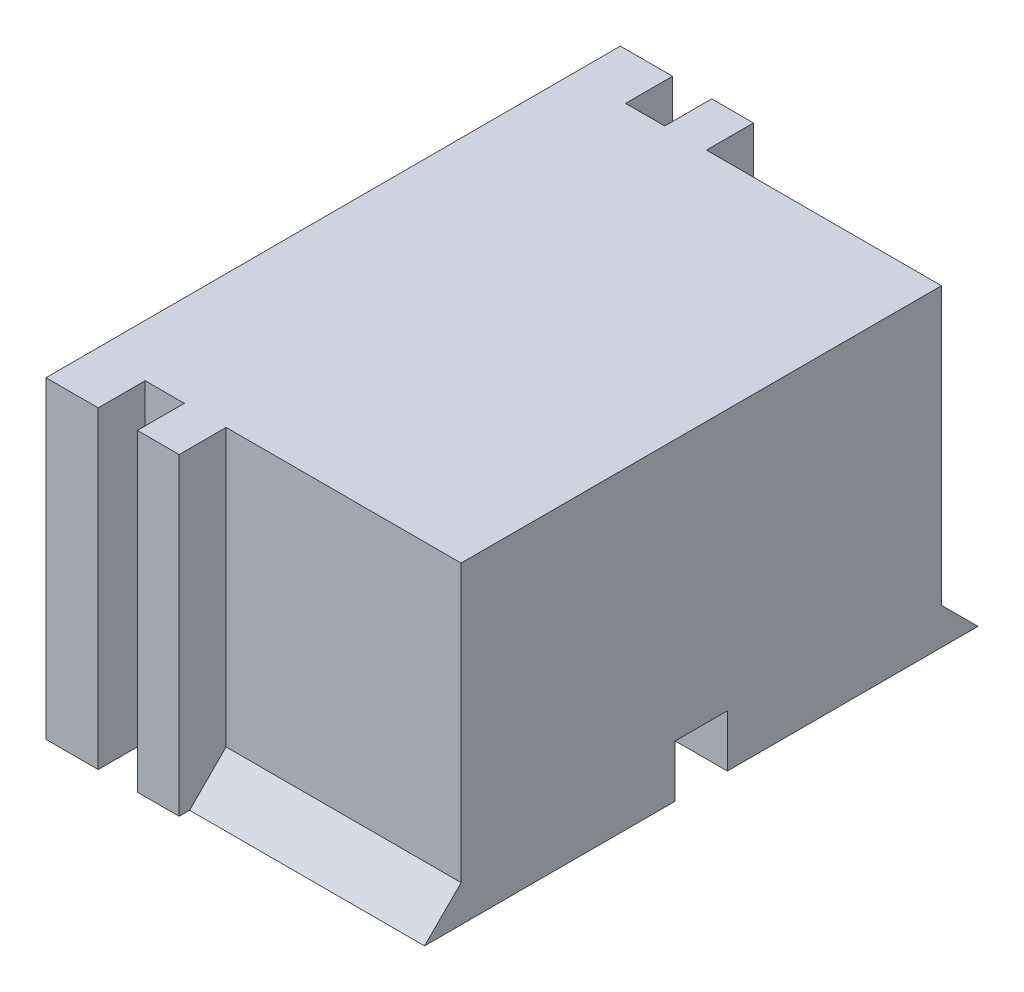
ISO-10303-21;
HEADER;
FILE_DESCRIPTION(('STEP AP214'),'2;1');
FILE_NAME('part.step','',(''),(''),'','','');
FILE_SCHEMA(('AUTOMOTIVE_DESIGN { 1 0 10303 214 1 1 1 1 }'));
ENDSEC;
DATA;
#1=APPLICATION_CONTEXT('core data for automotive mechanical design processes');
#2=APPLICATION_PROTOCOL_DEFINITION('international standard','automotive_design',2000,#1);
#3=PRODUCT_CONTEXT('',#1,'mechanical');
#4=PRODUCT('Part','Part','',(#3));
#5=PRODUCT_RELATED_PRODUCT_CATEGORY('part','',(#4));
#6=PRODUCT_DEFINITION_FORMATION('','',#4);
#7=PRODUCT_DEFINITION_CONTEXT('part definition',#1,'design');
#8=PRODUCT_DEFINITION('design','',#6,#7);
#9=PRODUCT_DEFINITION_SHAPE('','',#8);
#10=(LENGTH_UNIT() NAMED_UNIT(*) SI_UNIT(.MILLI.,.METRE.));
#11=(NAMED_UNIT(*) PLANE_ANGLE_UNIT() SI_UNIT($,.RADIAN.));
#12=(NAMED_UNIT(*) SI_UNIT($,.STERADIAN.) SOLID_ANGLE_UNIT());
#13=UNCERTAINTY_MEASURE_WITH_UNIT(LENGTH_MEASURE(1.E-05),#10,'distance_accuracy_value','');
#14=(GEOMETRIC_REPRESENTATION_CONTEXT(3) GLOBAL_UNCERTAINTY_ASSIGNED_CONTEXT((#13)) GLOBAL_UNIT_ASSIGNED_CONTEXT((#10,
#11,#12)) REPRESENTATION_CONTEXT('',''));
#15=CARTESIAN_POINT('',(0.,0.,0.));
#16=DIRECTION('',(0.,0.,1.));
#17=DIRECTION('',(1.,0.,0.));
#18=AXIS2_PLACEMENT_3D('',#15,#16,#17);
#19=CARTESIAN_POINT('',(-2.08730158730159,-5.26031746031746,11.));
#20=DIRECTION('',(0.,1.,0.));
#21=DIRECTION('',(0.,0.,1.));
#22=AXIS2_PLACEMENT_3D('',#19,#20,#21);
#23=PLANE('',#22);
#24=DIRECTION('',(1.,0.,0.));
#25=VECTOR('',#24,1.);
#26=CARTESIAN_POINT('',(0.0126984126984104,-5.26031746031746,12.));
#27=LINE('',#26,#25);
#28=CARTESIAN_POINT('',(0.0126984126984104,-5.26031746031746,12.));
#29=VERTEX_POINT('',#28);
#30=CARTESIAN_POINT('',(12.0126984126984,-5.26031746031746,12.));
#31=VERTEX_POINT('',#30);
#32=EDGE_CURVE('E209',#29,#31,#27,.T.);
#33=ORIENTED_EDGE('',*,*,#32,.T.);
#34=DIRECTION('',(0.,0.,1.));
#35=VECTOR('',#34,1.);
#36=CARTESIAN_POINT('',(12.0126984126984,-5.26031746031746,11.));
#37=LINE('',#36,#35);
#38=CARTESIAN_POINT('',(12.0126984126984,-5.26031746031746,21.6));
#39=VERTEX_POINT('',#38);
#40=EDGE_CURVE('E306',#31,#39,#37,.T.);
#41=ORIENTED_EDGE('',*,*,#40,.T.);
#42=DIRECTION('',(1.,0.,0.));
#43=VECTOR('',#42,1.);
#44=CARTESIAN_POINT('',(3.01269841269841,-5.26031746031746,21.6));
#45=LINE('',#44,#43);
#46=CARTESIAN_POINT('',(3.01269841269841,-5.26031746031746,21.6));
#47=VERTEX_POINT('',#46);
#48=EDGE_CURVE('E230',#47,#39,#45,.T.);
#49=ORIENTED_EDGE('',*,*,#48,.F.);
#50=DIRECTION('',(0.,0.,1.));
#51=VECTOR('',#50,1.);
#52=CARTESIAN_POINT('',(3.01269841269841,-5.26031746031746,20.2));
#53=LINE('',#52,#51);
#54=CARTESIAN_POINT('',(3.01269841269841,-5.26031746031746,22.));
#55=VERTEX_POINT('',#54);
#56=EDGE_CURVE('E253',#47,#55,#53,.T.);
#57=ORIENTED_EDGE('',*,*,#56,.T.);
#58=DIRECTION('',(1.,0.,0.));
#59=VECTOR('',#58,1.);
#60=CARTESIAN_POINT('',(-2.08730158730159,-5.26031746031746,22.));
#61=LINE('',#60,#59);
#62=CARTESIAN_POINT('',(1.41269841269841,-5.26031746031746,22.));
#63=VERTEX_POINT('',#62);
#64=EDGE_CURVE('E301',#63,#55,#61,.T.);
#65=ORIENTED_EDGE('',*,*,#64,.F.);
#66=DIRECTION('',(0.,0.,1.));
#67=VECTOR('',#66,1.);
#68=CARTESIAN_POINT('',(1.41269841269841,-5.26031746031746,20.2));
#69=LINE('',#68,#67);
#70=CARTESIAN_POINT('',(1.41269841269841,-5.26031746031746,20.2));
#71=VERTEX_POINT('',#70);
#72=EDGE_CURVE('E281',#71,#63,#69,.T.);
#73=ORIENTED_EDGE('',*,*,#72,.F.);
#74=DIRECTION('',(-1.,0.,0.));
#75=VECTOR('',#74,1.);
#76=CARTESIAN_POINT('',(1.41269841269841,-5.26031746031746,20.2));
#77=LINE('',#76,#75);
#78=CARTESIAN_POINT('',(-0.0873015873015903,-5.26031746031746,20.2));
#79=VERTEX_POINT('',#78);
#80=EDGE_CURVE('E271',#71,#79,#77,.T.);
#81=ORIENTED_EDGE('',*,*,#80,.T.);
#82=DIRECTION('',(0.,0.,1.));
#83=VECTOR('',#82,1.);
#84=CARTESIAN_POINT('',(-0.0873015873015903,-5.26031746031746,20.2));
#85=LINE('',#84,#83);
#86=CARTESIAN_POINT('',(-0.0873015873015903,-5.26031746031746,22.));
#87=VERTEX_POINT('',#86);
#88=EDGE_CURVE('E285',#79,#87,#85,.T.);
#89=ORIENTED_EDGE('',*,*,#88,.T.);
#90=CARTESIAN_POINT('',(-2.08730158730159,-5.26031746031746,22.));
#91=VERTEX_POINT('',#90);
#92=EDGE_CURVE('E302',#91,#87,#61,.T.);
#93=ORIENTED_EDGE('',*,*,#92,.F.);
#94=DIRECTION('',(0.,0.,-1.));
#95=VECTOR('',#94,1.);
#96=CARTESIAN_POINT('',(-2.08730158730159,-5.26031746031746,11.));
#97=LINE('',#96,#95);
#98=CARTESIAN_POINT('',(-2.08730158730159,-5.26031746031746,0.));
#99=VERTEX_POINT('',#98);
#100=EDGE_CURVE('E11',#91,#99,#97,.T.);
#101=ORIENTED_EDGE('',*,*,#100,.T.);
#102=DIRECTION('',(1.,0.,0.));
#103=VECTOR('',#102,1.);
#104=CARTESIAN_POINT('',(-2.08730158730159,-5.26031746031746,0.));
#105=LINE('',#104,#103);
#106=CARTESIAN_POINT('',(-0.0873015873015903,-5.26031746031746,0.));
#107=VERTEX_POINT('',#106);
#108=EDGE_CURVE('E401',#99,#107,#105,.T.);
#109=ORIENTED_EDGE('',*,*,#108,.T.);
#110=DIRECTION('',(0.,0.,-1.));
#111=VECTOR('',#110,1.);
#112=CARTESIAN_POINT('',(-0.0873015873015903,-5.26031746031746,1.8));
#113=LINE('',#112,#111);
#114=CARTESIAN_POINT('',(-0.0873015873015903,-5.26031746031746,1.8));
#115=VERTEX_POINT('',#114);
#116=EDGE_CURVE('E391',#115,#107,#113,.T.);
#117=ORIENTED_EDGE('',*,*,#116,.F.);
#118=DIRECTION('',(-1.,0.,0.));
#119=VECTOR('',#118,1.);
#120=CARTESIAN_POINT('',(1.41269841269841,-5.26031746031746,1.8));
#121=LINE('',#120,#119);
#122=CARTESIAN_POINT('',(1.41269841269841,-5.26031746031746,1.8));
#123=VERTEX_POINT('',#122);
#124=EDGE_CURVE('E364',#123,#115,#121,.T.);
#125=ORIENTED_EDGE('',*,*,#124,.F.);
#126=DIRECTION('',(0.,0.,-1.));
#127=VECTOR('',#126,1.);
#128=CARTESIAN_POINT('',(1.41269841269841,-5.26031746031746,1.8));
#129=LINE('',#128,#127);
#130=CARTESIAN_POINT('',(1.41269841269841,-5.26031746031746,0.));
#131=VERTEX_POINT('',#130);
#132=EDGE_CURVE('E377',#123,#131,#129,.T.);
#133=ORIENTED_EDGE('',*,*,#132,.T.);
#134=CARTESIAN_POINT('',(3.01269841269841,-5.26031746031746,0.));
#135=VERTEX_POINT('',#134);
#136=EDGE_CURVE('E400',#131,#135,#105,.T.);
#137=ORIENTED_EDGE('',*,*,#136,.T.);
#138=DIRECTION('',(0.,0.,-1.));
#139=VECTOR('',#138,1.);
#140=CARTESIAN_POINT('',(3.01269841269841,-5.26031746031746,1.8));
#141=LINE('',#140,#139);
#142=CARTESIAN_POINT('',(3.01269841269841,-5.26031746031746,0.4));
#143=VERTEX_POINT('',#142);
#144=EDGE_CURVE('E350',#143,#135,#141,.T.);
#145=ORIENTED_EDGE('',*,*,#144,.F.);
#146=DIRECTION('',(1.,0.,0.));
#147=VECTOR('',#146,1.);
#148=CARTESIAN_POINT('',(3.01269841269841,-5.26031746031746,0.4));
#149=LINE('',#148,#147);
#150=CARTESIAN_POINT('',(12.0126984126984,-5.26031746031746,0.4));
#151=VERTEX_POINT('',#150);
#152=EDGE_CURVE('E328',#143,#151,#149,.T.);
#153=ORIENTED_EDGE('',*,*,#152,.T.);
#154=DIRECTION('',(0.,0.,-1.));
#155=VECTOR('',#154,1.);
#156=CARTESIAN_POINT('',(12.0126984126984,-5.26031746031746,11.));
#157=LINE('',#156,#155);
#158=CARTESIAN_POINT('',(12.0126984126984,-5.26031746031746,10.));
#159=VERTEX_POINT('',#158);
#160=EDGE_CURVE('E48',#159,#151,#157,.T.);
#161=ORIENTED_EDGE('',*,*,#160,.F.);
#162=DIRECTION('',(1.,0.,0.));
#163=VECTOR('',#162,1.);
#164=CARTESIAN_POINT('',(0.0126984126984104,-5.26031746031746,10.));
#165=LINE('',#164,#163);
#166=CARTESIAN_POINT('',(0.0126984126984104,-5.26031746031746,10.));
#167=VERTEX_POINT('',#166);
#168=EDGE_CURVE('E200',#167,#159,#165,.T.);
#169=ORIENTED_EDGE('',*,*,#168,.F.);
#170=DIRECTION('',(0.,0.,-1.));
#171=VECTOR('',#170,1.);
#172=CARTESIAN_POINT('',(0.0126984126984104,-5.26031746031746,11.));
#173=LINE('',#172,#171);
#174=EDGE_CURVE('E310',#29,#167,#173,.T.);
#175=ORIENTED_EDGE('',*,*,#174,.F.);
#176=EDGE_LOOP('',(#33,#41,#49,#57,#65,#73,#81,#89,#93,#101,#109,#117,#125,#133,#137,#145,#153,
#161,#169,#175));
#177=FACE_BOUND('',#176,.T.);
#178=ADVANCED_FACE('F39',(#177),#23,.F.);
#179=CARTESIAN_POINT('',(12.0126984126984,6.73968253968254,11.));
#180=DIRECTION('',(-1.,0.,0.));
#181=DIRECTION('',(0.,0.,1.));
#182=AXIS2_PLACEMENT_3D('',#179,#180,#181);
#183=PLANE('',#182);
#184=DIRECTION('',(0.,1.,0.));
#185=VECTOR('',#184,1.);
#186=CARTESIAN_POINT('',(12.0126984126984,-3.26031746031746,12.));
#187=LINE('',#186,#185);
#188=CARTESIAN_POINT('',(12.0126984126984,-3.26031746031746,12.));
#189=VERTEX_POINT('',#188);
#190=EDGE_CURVE('E211',#31,#189,#187,.T.);
#191=ORIENTED_EDGE('',*,*,#190,.T.);
#192=DIRECTION('',(0.,0.,1.));
#193=VECTOR('',#192,1.);
#194=CARTESIAN_POINT('',(12.0126984126984,-3.26031746031746,11.));
#195=LINE('',#194,#193);
#196=CARTESIAN_POINT('',(12.0126984126984,-3.26031746031746,10.));
#197=VERTEX_POINT('',#196);
#198=EDGE_CURVE('E215',#197,#189,#195,.T.);
#199=ORIENTED_EDGE('',*,*,#198,.F.);
#200=DIRECTION('',(0.,1.,0.));
#201=VECTOR('',#200,1.);
#202=CARTESIAN_POINT('',(12.0126984126984,-3.26031746031746,10.));
#203=LINE('',#202,#201);
#204=EDGE_CURVE('E309',#159,#197,#203,.T.);
#205=ORIENTED_EDGE('',*,*,#204,.F.);
#206=ORIENTED_EDGE('',*,*,#160,.T.);
#207=DIRECTION('',(0.,0.707106781186548,0.707106781186547));
#208=VECTOR('',#207,1.);
#209=CARTESIAN_POINT('',(12.0126984126984,-5.26031746031746,0.4));
#210=LINE('',#209,#208);
#211=CARTESIAN_POINT('',(12.0126984126984,-3.86031746031746,1.8));
#212=VERTEX_POINT('',#211);
#213=EDGE_CURVE('E323',#151,#212,#210,.T.);
#214=ORIENTED_EDGE('',*,*,#213,.T.);
#215=DIRECTION('',(0.,-1.,0.));
#216=VECTOR('',#215,1.);
#217=CARTESIAN_POINT('',(12.0126984126984,6.73968253968254,1.8));
#218=LINE('',#217,#216);
#219=CARTESIAN_POINT('',(12.0126984126984,6.73968253968254,1.8));
#220=VERTEX_POINT('',#219);
#221=EDGE_CURVE('E340',#220,#212,#218,.T.);
#222=ORIENTED_EDGE('',*,*,#221,.F.);
#223=DIRECTION('',(0.,0.,-1.));
#224=VECTOR('',#223,1.);
#225=CARTESIAN_POINT('',(12.0126984126984,6.73968253968254,11.));
#226=LINE('',#225,#224);
#227=CARTESIAN_POINT('',(12.0126984126984,6.73968253968254,20.2));
#228=VERTEX_POINT('',#227);
#229=EDGE_CURVE('E413',#228,#220,#226,.T.);
#230=ORIENTED_EDGE('',*,*,#229,.F.);
#231=DIRECTION('',(0.,-1.,0.));
#232=VECTOR('',#231,1.);
#233=CARTESIAN_POINT('',(12.0126984126984,6.73968253968254,20.2));
#234=LINE('',#233,#232);
#235=CARTESIAN_POINT('',(12.0126984126984,-3.86031746031746,20.2));
#236=VERTEX_POINT('',#235);
#237=EDGE_CURVE('E238',#228,#236,#234,.T.);
#238=ORIENTED_EDGE('',*,*,#237,.T.);
#239=DIRECTION('',(0.,0.707106781186548,-0.707106781186547));
#240=VECTOR('',#239,1.);
#241=CARTESIAN_POINT('',(12.0126984126984,-5.26031746031746,21.6));
#242=LINE('',#241,#240);
#243=EDGE_CURVE('E219',#39,#236,#242,.T.);
#244=ORIENTED_EDGE('',*,*,#243,.F.);
#245=ORIENTED_EDGE('',*,*,#40,.F.);
#246=EDGE_LOOP('',(#191,#199,#205,#206,#214,#222,#230,#238,#244,#245));
#247=FACE_BOUND('',#246,.T.);
#248=ADVANCED_FACE('F419',(#247),#183,.F.);
#249=CARTESIAN_POINT('',(3.01269841269841,6.73968253968254,20.2));
#250=DIRECTION('',(1.,0.,0.));
#251=DIRECTION('',(0.,1.,0.));
#252=AXIS2_PLACEMENT_3D('',#249,#250,#251);
#253=PLANE('',#252);
#254=ORIENTED_EDGE('',*,*,#56,.F.);
#255=DIRECTION('',(0.,0.707106781186548,-0.707106781186547));
#256=VECTOR('',#255,1.);
#257=CARTESIAN_POINT('',(3.01269841269841,-5.26031746031746,21.6));
#258=LINE('',#257,#256);
#259=CARTESIAN_POINT('',(3.01269841269841,-3.86031746031746,20.2));
#260=VERTEX_POINT('',#259);
#261=EDGE_CURVE('E223',#47,#260,#258,.T.);
#262=ORIENTED_EDGE('',*,*,#261,.T.);
#263=DIRECTION('',(0.,1.,0.));
#264=VECTOR('',#263,1.);
#265=CARTESIAN_POINT('',(3.01269841269841,6.73968253968254,20.2));
#266=LINE('',#265,#264);
#267=CARTESIAN_POINT('',(3.01269841269841,6.73968253968254,20.2));
#268=VERTEX_POINT('',#267);
#269=EDGE_CURVE('E246',#260,#268,#266,.T.);
#270=ORIENTED_EDGE('',*,*,#269,.T.);
#271=DIRECTION('',(0.,0.,1.));
#272=VECTOR('',#271,1.);
#273=CARTESIAN_POINT('',(3.01269841269841,6.73968253968254,20.2));
#274=LINE('',#273,#272);
#275=CARTESIAN_POINT('',(3.01269841269841,6.73968253968254,22.));
#276=VERTEX_POINT('',#275);
#277=EDGE_CURVE('E249',#268,#276,#274,.T.);
#278=ORIENTED_EDGE('',*,*,#277,.T.);
#279=DIRECTION('',(0.,1.,0.));
#280=VECTOR('',#279,1.);
#281=CARTESIAN_POINT('',(3.01269841269841,6.73968253968254,22.));
#282=LINE('',#281,#280);
#283=EDGE_CURVE('E234',#55,#276,#282,.T.);
#284=ORIENTED_EDGE('',*,*,#283,.F.);
#285=EDGE_LOOP('',(#254,#262,#270,#278,#284));
#286=FACE_BOUND('',#285,.T.);
#287=ADVANCED_FACE('F449',(#286),#253,.T.);
#288=CARTESIAN_POINT('',(0.,0.,20.2));
#289=DIRECTION('',(0.,0.,1.));
#290=DIRECTION('',(-1.,0.,0.));
#291=AXIS2_PLACEMENT_3D('',#288,#289,#290);
#292=PLANE('',#291);
#293=ORIENTED_EDGE('',*,*,#269,.F.);
#294=DIRECTION('',(1.,0.,0.));
#295=VECTOR('',#294,1.);
#296=CARTESIAN_POINT('',(3.01269841269841,-3.86031746031746,20.2));
#297=LINE('',#296,#295);
#298=EDGE_CURVE('E227',#260,#236,#297,.T.);
#299=ORIENTED_EDGE('',*,*,#298,.T.);
#300=ORIENTED_EDGE('',*,*,#237,.F.);
#301=DIRECTION('',(1.,0.,0.));
#302=VECTOR('',#301,1.);
#303=CARTESIAN_POINT('',(12.0126984126984,6.73968253968254,20.2));
#304=LINE('',#303,#302);
#305=EDGE_CURVE('E242',#268,#228,#304,.T.);
#306=ORIENTED_EDGE('',*,*,#305,.F.);
#307=EDGE_LOOP('',(#293,#299,#300,#306));
#308=FACE_BOUND('',#307,.T.);
#309=ADVANCED_FACE('F444',(#308),#292,.T.);
#310=CARTESIAN_POINT('',(-2.08730158730159,6.73968253968254,11.));
#311=DIRECTION('',(0.,-1.,0.));
#312=DIRECTION('',(0.,0.,-1.));
#313=AXIS2_PLACEMENT_3D('',#310,#311,#312);
#314=PLANE('',#313);
#315=ORIENTED_EDGE('',*,*,#277,.F.);
#316=ORIENTED_EDGE('',*,*,#305,.T.);
#317=ORIENTED_EDGE('',*,*,#229,.T.);
#318=DIRECTION('',(1.,0.,0.));
#319=VECTOR('',#318,1.);
#320=CARTESIAN_POINT('',(12.0126984126984,6.73968253968254,1.8));
#321=LINE('',#320,#319);
#322=CARTESIAN_POINT('',(3.01269841269841,6.73968253968254,1.8));
#323=VERTEX_POINT('',#322);
#324=EDGE_CURVE('E346',#323,#220,#321,.T.);
#325=ORIENTED_EDGE('',*,*,#324,.F.);
#326=DIRECTION('',(0.,0.,-1.));
#327=VECTOR('',#326,1.);
#328=CARTESIAN_POINT('',(3.01269841269841,6.73968253968254,1.8));
#329=LINE('',#328,#327);
#330=CARTESIAN_POINT('',(3.01269841269841,6.73968253968254,0.));
#331=VERTEX_POINT('',#330);
#332=EDGE_CURVE('E353',#323,#331,#329,.T.);
#333=ORIENTED_EDGE('',*,*,#332,.T.);
#334=DIRECTION('',(-1.,0.,0.));
#335=VECTOR('',#334,1.);
#336=CARTESIAN_POINT('',(-2.08730158730159,6.73968253968254,0.));
#337=LINE('',#336,#335);
#338=CARTESIAN_POINT('',(1.41269841269841,6.73968253968254,0.));
#339=VERTEX_POINT('',#338);
#340=EDGE_CURVE('E406',#331,#339,#337,.T.);
#341=ORIENTED_EDGE('',*,*,#340,.T.);
#342=DIRECTION('',(0.,0.,-1.));
#343=VECTOR('',#342,1.);
#344=CARTESIAN_POINT('',(1.41269841269841,6.73968253968254,1.8));
#345=LINE('',#344,#343);
#346=CARTESIAN_POINT('',(1.41269841269841,6.73968253968254,1.8));
#347=VERTEX_POINT('',#346);
#348=EDGE_CURVE('E382',#347,#339,#345,.T.);
#349=ORIENTED_EDGE('',*,*,#348,.F.);
#350=DIRECTION('',(1.,0.,0.));
#351=VECTOR('',#350,1.);
#352=CARTESIAN_POINT('',(1.41269841269841,6.73968253968254,1.8));
#353=LINE('',#352,#351);
#354=CARTESIAN_POINT('',(-0.087301587301589,6.73968253968254,1.8));
#355=VERTEX_POINT('',#354);
#356=EDGE_CURVE('E373',#355,#347,#353,.T.);
#357=ORIENTED_EDGE('',*,*,#356,.F.);
#358=DIRECTION('',(0.,0.,-1.));
#359=VECTOR('',#358,1.);
#360=CARTESIAN_POINT('',(-0.087301587301589,6.73968253968254,1.8));
#361=LINE('',#360,#359);
#362=CARTESIAN_POINT('',(-0.087301587301589,6.73968253968254,0.));
#363=VERTEX_POINT('',#362);
#364=EDGE_CURVE('E387',#355,#363,#361,.T.);
#365=ORIENTED_EDGE('',*,*,#364,.T.);
#366=CARTESIAN_POINT('',(-2.08730158730159,6.73968253968254,0.));
#367=VERTEX_POINT('',#366);
#368=EDGE_CURVE('E405',#363,#367,#337,.T.);
#369=ORIENTED_EDGE('',*,*,#368,.T.);
#370=DIRECTION('',(0.,0.,-1.));
#371=VECTOR('',#370,1.);
#372=CARTESIAN_POINT('',(-2.08730158730159,6.73968253968254,11.));
#373=LINE('',#372,#371);
#374=CARTESIAN_POINT('',(-2.08730158730159,6.73968253968254,22.));
#375=VERTEX_POINT('',#374);
#376=EDGE_CURVE('E409',#375,#367,#373,.T.);
#377=ORIENTED_EDGE('',*,*,#376,.F.);
#378=DIRECTION('',(-1.,0.,0.));
#379=VECTOR('',#378,1.);
#380=CARTESIAN_POINT('',(-2.08730158730159,6.73968253968254,22.));
#381=LINE('',#380,#379);
#382=CARTESIAN_POINT('',(-0.087301587301589,6.73968253968254,22.));
#383=VERTEX_POINT('',#382);
#384=EDGE_CURVE('E297',#383,#375,#381,.T.);
#385=ORIENTED_EDGE('',*,*,#384,.F.);
#386=DIRECTION('',(0.,0.,1.));
#387=VECTOR('',#386,1.);
#388=CARTESIAN_POINT('',(-0.087301587301589,6.73968253968254,20.2));
#389=LINE('',#388,#387);
#390=CARTESIAN_POINT('',(-0.087301587301589,6.73968253968254,20.2));
#391=VERTEX_POINT('',#390);
#392=EDGE_CURVE('E55',#391,#383,#389,.T.);
#393=ORIENTED_EDGE('',*,*,#392,.F.);
#394=DIRECTION('',(1.,0.,0.));
#395=VECTOR('',#394,1.);
#396=CARTESIAN_POINT('',(1.41269841269841,6.73968253968254,20.2));
#397=LINE('',#396,#395);
#398=CARTESIAN_POINT('',(1.41269841269841,6.73968253968254,20.2));
#399=VERTEX_POINT('',#398);
#400=EDGE_CURVE('E263',#391,#399,#397,.T.);
#401=ORIENTED_EDGE('',*,*,#400,.T.);
#402=DIRECTION('',(0.,0.,1.));
#403=VECTOR('',#402,1.);
#404=CARTESIAN_POINT('',(1.41269841269841,6.73968253968254,20.2));
#405=LINE('',#404,#403);
#406=CARTESIAN_POINT('',(1.41269841269841,6.73968253968254,22.));
#407=VERTEX_POINT('',#406);
#408=EDGE_CURVE('E275',#399,#407,#405,.T.);
#409=ORIENTED_EDGE('',*,*,#408,.T.);
#410=EDGE_CURVE('E298',#276,#407,#381,.T.);
#411=ORIENTED_EDGE('',*,*,#410,.F.);
#412=EDGE_LOOP('',(#315,#316,#317,#325,#333,#341,#349,#357,#365,#369,#377,#385,#393,#401,#409,#411));
#413=FACE_BOUND('',#412,.T.);
#414=ADVANCED_FACE('F437',(#413),#314,.F.);
#415=CARTESIAN_POINT('',(0.,0.,22.));
#416=DIRECTION('',(0.,0.,-1.));
#417=DIRECTION('',(1.,0.,0.));
#418=AXIS2_PLACEMENT_3D('',#415,#416,#417);
#419=PLANE('',#418);
#420=ORIENTED_EDGE('',*,*,#283,.T.);
#421=ORIENTED_EDGE('',*,*,#410,.T.);
#422=DIRECTION('',(0.,-1.,0.));
#423=VECTOR('',#422,1.);
#424=CARTESIAN_POINT('',(1.41269841269841,6.73968253968254,22.));
#425=LINE('',#424,#423);
#426=EDGE_CURVE('E256',#407,#63,#425,.T.);
#427=ORIENTED_EDGE('',*,*,#426,.T.);
#428=ORIENTED_EDGE('',*,*,#64,.T.);
#429=EDGE_LOOP('',(#420,#421,#427,#428));
#430=FACE_BOUND('',#429,.T.);
#431=ADVANCED_FACE('F452',(#430),#419,.F.);
#432=DIRECTION('',(0.,1.,0.));
#433=VECTOR('',#432,1.);
#434=CARTESIAN_POINT('',(-0.087301587301589,6.73968253968254,22.));
#435=LINE('',#434,#433);
#436=EDGE_CURVE('E264',#87,#383,#435,.T.);
#437=ORIENTED_EDGE('',*,*,#436,.T.);
#438=ORIENTED_EDGE('',*,*,#384,.T.);
#439=DIRECTION('',(0.,-1.,0.));
#440=VECTOR('',#439,1.);
#441=CARTESIAN_POINT('',(-2.08730158730159,6.73968253968254,22.));
#442=LINE('',#441,#440);
#443=EDGE_CURVE('E284',#375,#91,#442,.T.);
#444=ORIENTED_EDGE('',*,*,#443,.T.);
#445=ORIENTED_EDGE('',*,*,#92,.T.);
#446=EDGE_LOOP('',(#437,#438,#444,#445));
#447=FACE_BOUND('',#446,.T.);
#448=ADVANCED_FACE('F461',(#447),#419,.F.);
#449=CARTESIAN_POINT('',(0.,0.,0.));
#450=DIRECTION('',(0.,0.,1.));
#451=DIRECTION('',(1.,0.,0.));
#452=AXIS2_PLACEMENT_3D('',#449,#450,#451);
#453=PLANE('',#452);
#454=ORIENTED_EDGE('',*,*,#340,.F.);
#455=DIRECTION('',(0.,1.,0.));
#456=VECTOR('',#455,1.);
#457=CARTESIAN_POINT('',(3.01269841269841,6.73968253968254,0.));
#458=LINE('',#457,#456);
#459=EDGE_CURVE('E336',#135,#331,#458,.T.);
#460=ORIENTED_EDGE('',*,*,#459,.F.);
#461=ORIENTED_EDGE('',*,*,#136,.F.);
#462=DIRECTION('',(0.,-1.,0.));
#463=VECTOR('',#462,1.);
#464=CARTESIAN_POINT('',(1.41269841269841,6.73968253968254,0.));
#465=LINE('',#464,#463);
#466=EDGE_CURVE('E357',#339,#131,#465,.T.);
#467=ORIENTED_EDGE('',*,*,#466,.F.);
#468=EDGE_LOOP('',(#454,#460,#461,#467));
#469=FACE_BOUND('',#468,.T.);
#470=ADVANCED_FACE('F499',(#469),#453,.F.);
#471=CARTESIAN_POINT('',(-2.08730158730159,6.73968253968254,11.));
#472=DIRECTION('',(1.,0.,0.));
#473=DIRECTION('',(0.,1.,0.));
#474=AXIS2_PLACEMENT_3D('',#471,#472,#473);
#475=PLANE('',#474);
#476=DIRECTION('',(0.,-1.,0.));
#477=VECTOR('',#476,1.);
#478=CARTESIAN_POINT('',(-2.08730158730159,6.73968253968254,0.));
#479=LINE('',#478,#477);
#480=EDGE_CURVE('E386',#367,#99,#479,.T.);
#481=ORIENTED_EDGE('',*,*,#480,.T.);
#482=ORIENTED_EDGE('',*,*,#100,.F.);
#483=ORIENTED_EDGE('',*,*,#443,.F.);
#484=ORIENTED_EDGE('',*,*,#376,.T.);
#485=EDGE_LOOP('',(#481,#482,#483,#484));
#486=FACE_BOUND('',#485,.T.);
#487=ADVANCED_FACE('F41',(#486),#475,.F.);
#488=ORIENTED_EDGE('',*,*,#368,.F.);
#489=DIRECTION('',(0.,1.,0.));
#490=VECTOR('',#489,1.);
#491=CARTESIAN_POINT('',(-0.087301587301589,6.73968253968254,0.));
#492=LINE('',#491,#490);
#493=EDGE_CURVE('E365',#107,#363,#492,.T.);
#494=ORIENTED_EDGE('',*,*,#493,.F.);
#495=ORIENTED_EDGE('',*,*,#108,.F.);
#496=ORIENTED_EDGE('',*,*,#480,.F.);
#497=EDGE_LOOP('',(#488,#494,#495,#496));
#498=FACE_BOUND('',#497,.T.);
#499=ADVANCED_FACE('F494',(#498),#453,.F.);
#500=CARTESIAN_POINT('',(1.41269841269841,6.73968253968254,1.8));
#501=DIRECTION('',(1.,0.,0.));
#502=DIRECTION('',(0.,1.,0.));
#503=AXIS2_PLACEMENT_3D('',#500,#501,#502);
#504=PLANE('',#503);
#505=ORIENTED_EDGE('',*,*,#466,.T.);
#506=ORIENTED_EDGE('',*,*,#132,.F.);
#507=DIRECTION('',(0.,-1.,0.));
#508=VECTOR('',#507,1.);
#509=CARTESIAN_POINT('',(1.41269841269841,6.73968253968254,1.8));
#510=LINE('',#509,#508);
#511=EDGE_CURVE('E360',#347,#123,#510,.T.);
#512=ORIENTED_EDGE('',*,*,#511,.F.);
#513=ORIENTED_EDGE('',*,*,#348,.T.);
#514=EDGE_LOOP('',(#505,#506,#512,#513));
#515=FACE_BOUND('',#514,.T.);
#516=ADVANCED_FACE('F497',(#515),#504,.F.);
#517=CARTESIAN_POINT('',(-0.087301587301589,6.73968253968254,1.8));
#518=DIRECTION('',(-1.,0.,0.));
#519=DIRECTION('',(0.,-1.,0.));
#520=AXIS2_PLACEMENT_3D('',#517,#518,#519);
#521=PLANE('',#520);
#522=ORIENTED_EDGE('',*,*,#493,.T.);
#523=ORIENTED_EDGE('',*,*,#364,.F.);
#524=DIRECTION('',(0.,1.,0.));
#525=VECTOR('',#524,1.);
#526=CARTESIAN_POINT('',(-0.087301587301589,6.73968253968254,1.8));
#527=LINE('',#526,#525);
#528=EDGE_CURVE('E369',#115,#355,#527,.T.);
#529=ORIENTED_EDGE('',*,*,#528,.F.);
#530=ORIENTED_EDGE('',*,*,#116,.T.);
#531=EDGE_LOOP('',(#522,#523,#529,#530));
#532=FACE_BOUND('',#531,.T.);
#533=ADVANCED_FACE('F502',(#532),#521,.F.);
#534=CARTESIAN_POINT('',(0.,0.,1.8));
#535=DIRECTION('',(0.,0.,-1.));
#536=DIRECTION('',(-1.,0.,0.));
#537=AXIS2_PLACEMENT_3D('',#534,#535,#536);
#538=PLANE('',#537);
#539=ORIENTED_EDGE('',*,*,#511,.T.);
#540=ORIENTED_EDGE('',*,*,#124,.T.);
#541=ORIENTED_EDGE('',*,*,#528,.T.);
#542=ORIENTED_EDGE('',*,*,#356,.T.);
#543=EDGE_LOOP('',(#539,#540,#541,#542));
#544=FACE_BOUND('',#543,.T.);
#545=ADVANCED_FACE('F506',(#544),#538,.T.);
#546=CARTESIAN_POINT('',(3.01269841269841,6.73968253968254,1.8));
#547=DIRECTION('',(-1.,0.,0.));
#548=DIRECTION('',(0.,-1.,0.));
#549=AXIS2_PLACEMENT_3D('',#546,#547,#548);
#550=PLANE('',#549);
#551=DIRECTION('',(0.,1.,0.));
#552=VECTOR('',#551,1.);
#553=CARTESIAN_POINT('',(3.01269841269841,6.73968253968254,1.8));
#554=LINE('',#553,#552);
#555=CARTESIAN_POINT('',(3.01269841269841,-3.86031746031746,1.8));
#556=VERTEX_POINT('',#555);
#557=EDGE_CURVE('E343',#556,#323,#554,.T.);
#558=ORIENTED_EDGE('',*,*,#557,.F.);
#559=DIRECTION('',(0.,0.707106781186548,0.707106781186547));
#560=VECTOR('',#559,1.);
#561=CARTESIAN_POINT('',(3.01269841269841,-5.26031746031746,0.4));
#562=LINE('',#561,#560);
#563=EDGE_CURVE('E63',#143,#556,#562,.T.);
#564=ORIENTED_EDGE('',*,*,#563,.F.);
#565=ORIENTED_EDGE('',*,*,#144,.T.);
#566=ORIENTED_EDGE('',*,*,#459,.T.);
#567=ORIENTED_EDGE('',*,*,#332,.F.);
#568=EDGE_LOOP('',(#558,#564,#565,#566,#567));
#569=FACE_BOUND('',#568,.T.);
#570=ADVANCED_FACE('F431',(#569),#550,.F.);
#571=CARTESIAN_POINT('',(0.,0.,1.8));
#572=DIRECTION('',(0.,0.,-1.));
#573=DIRECTION('',(-1.,0.,0.));
#574=AXIS2_PLACEMENT_3D('',#571,#572,#573);
#575=PLANE('',#574);
#576=DIRECTION('',(1.,0.,0.));
#577=VECTOR('',#576,1.);
#578=CARTESIAN_POINT('',(3.01269841269841,-3.86031746031746,1.8));
#579=LINE('',#578,#577);
#580=EDGE_CURVE('E332',#556,#212,#579,.T.);
#581=ORIENTED_EDGE('',*,*,#580,.F.);
#582=ORIENTED_EDGE('',*,*,#557,.T.);
#583=ORIENTED_EDGE('',*,*,#324,.T.);
#584=ORIENTED_EDGE('',*,*,#221,.T.);
#585=EDGE_LOOP('',(#581,#582,#583,#584));
#586=FACE_BOUND('',#585,.T.);
#587=ADVANCED_FACE('F429',(#586),#575,.T.);
#588=CARTESIAN_POINT('',(3.01269841269841,-5.26031746031746,0.4));
#589=DIRECTION('',(0.,0.707106781186547,-0.707106781186548));
#590=DIRECTION('',(0.,0.707106781186548,0.707106781186547));
#591=AXIS2_PLACEMENT_3D('',#588,#589,#590);
#592=PLANE('',#591);
#593=ORIENTED_EDGE('',*,*,#213,.F.);
#594=ORIENTED_EDGE('',*,*,#152,.F.);
#595=ORIENTED_EDGE('',*,*,#563,.T.);
#596=ORIENTED_EDGE('',*,*,#580,.T.);
#597=EDGE_LOOP('',(#593,#594,#595,#596));
#598=FACE_BOUND('',#597,.T.);
#599=ADVANCED_FACE('F427',(#598),#592,.T.);
#600=CARTESIAN_POINT('',(0.0126984126984104,-3.26031746031746,11.));
#601=DIRECTION('',(0.,1.,0.));
#602=DIRECTION('',(0.,0.,1.));
#603=AXIS2_PLACEMENT_3D('',#600,#601,#602);
#604=PLANE('',#603);
#605=ORIENTED_EDGE('',*,*,#198,.T.);
#606=DIRECTION('',(1.,0.,0.));
#607=VECTOR('',#606,1.);
#608=CARTESIAN_POINT('',(0.0126984126984104,-3.26031746031746,12.));
#609=LINE('',#608,#607);
#610=CARTESIAN_POINT('',(0.0126984126984104,-3.26031746031746,12.));
#611=VERTEX_POINT('',#610);
#612=EDGE_CURVE('E206',#611,#189,#609,.T.);
#613=ORIENTED_EDGE('',*,*,#612,.F.);
#614=DIRECTION('',(0.,0.,1.));
#615=VECTOR('',#614,1.);
#616=CARTESIAN_POINT('',(0.0126984126984104,-3.26031746031746,11.));
#617=LINE('',#616,#615);
#618=CARTESIAN_POINT('',(0.0126984126984104,-3.26031746031746,10.));
#619=VERTEX_POINT('',#618);
#620=EDGE_CURVE('E191',#619,#611,#617,.T.);
#621=ORIENTED_EDGE('',*,*,#620,.F.);
#622=DIRECTION('',(1.,0.,0.));
#623=VECTOR('',#622,1.);
#624=CARTESIAN_POINT('',(0.0126984126984104,-3.26031746031746,10.));
#625=LINE('',#624,#623);
#626=EDGE_CURVE('E320',#619,#197,#625,.T.);
#627=ORIENTED_EDGE('',*,*,#626,.T.);
#628=EDGE_LOOP('',(#605,#613,#621,#627));
#629=FACE_BOUND('',#628,.T.);
#630=ADVANCED_FACE('F213',(#629),#604,.F.);
#631=CARTESIAN_POINT('',(0.0126984126984104,-3.26031746031746,10.));
#632=DIRECTION('',(0.,0.,-1.));
#633=DIRECTION('',(0.,1.,0.));
#634=AXIS2_PLACEMENT_3D('',#631,#632,#633);
#635=PLANE('',#634);
#636=ORIENTED_EDGE('',*,*,#204,.T.);
#637=ORIENTED_EDGE('',*,*,#626,.F.);
#638=DIRECTION('',(0.,1.,0.));
#639=VECTOR('',#638,1.);
#640=CARTESIAN_POINT('',(0.0126984126984104,-3.26031746031746,10.));
#641=LINE('',#640,#639);
#642=EDGE_CURVE('E196',#167,#619,#641,.T.);
#643=ORIENTED_EDGE('',*,*,#642,.F.);
#644=ORIENTED_EDGE('',*,*,#168,.T.);
#645=EDGE_LOOP('',(#636,#637,#643,#644));
#646=FACE_BOUND('',#645,.T.);
#647=ADVANCED_FACE('F483',(#646),#635,.F.);
#648=CARTESIAN_POINT('',(0.0126984126984104,0.,0.));
#649=DIRECTION('',(1.,0.,0.));
#650=DIRECTION('',(0.,0.,-1.));
#651=AXIS2_PLACEMENT_3D('',#648,#649,#650);
#652=PLANE('',#651);
#653=ORIENTED_EDGE('',*,*,#620,.T.);
#654=DIRECTION('',(0.,1.,0.));
#655=VECTOR('',#654,1.);
#656=CARTESIAN_POINT('',(0.0126984126984104,-3.26031746031746,12.));
#657=LINE('',#656,#655);
#658=EDGE_CURVE('E195',#29,#611,#657,.T.);
#659=ORIENTED_EDGE('',*,*,#658,.F.);
#660=ORIENTED_EDGE('',*,*,#174,.T.);
#661=ORIENTED_EDGE('',*,*,#642,.T.);
#662=EDGE_LOOP('',(#653,#659,#660,#661));
#663=FACE_BOUND('',#662,.T.);
#664=ADVANCED_FACE('F193',(#663),#652,.T.);
#665=CARTESIAN_POINT('',(1.41269841269841,6.73968253968254,20.2));
#666=DIRECTION('',(-1.,0.,0.));
#667=DIRECTION('',(0.,-1.,0.));
#668=AXIS2_PLACEMENT_3D('',#665,#666,#667);
#669=PLANE('',#668);
#670=ORIENTED_EDGE('',*,*,#426,.F.);
#671=ORIENTED_EDGE('',*,*,#408,.F.);
#672=DIRECTION('',(0.,-1.,0.));
#673=VECTOR('',#672,1.);
#674=CARTESIAN_POINT('',(1.41269841269841,6.73968253968254,20.2));
#675=LINE('',#674,#673);
#676=EDGE_CURVE('E259',#399,#71,#675,.T.);
#677=ORIENTED_EDGE('',*,*,#676,.T.);
#678=ORIENTED_EDGE('',*,*,#72,.T.);
#679=EDGE_LOOP('',(#670,#671,#677,#678));
#680=FACE_BOUND('',#679,.T.);
#681=ADVANCED_FACE('F475',(#680),#669,.T.);
#682=CARTESIAN_POINT('',(-0.087301587301589,6.73968253968254,20.2));
#683=DIRECTION('',(1.,0.,0.));
#684=DIRECTION('',(0.,1.,0.));
#685=AXIS2_PLACEMENT_3D('',#682,#683,#684);
#686=PLANE('',#685);
#687=ORIENTED_EDGE('',*,*,#436,.F.);
#688=ORIENTED_EDGE('',*,*,#88,.F.);
#689=DIRECTION('',(0.,1.,0.));
#690=VECTOR('',#689,1.);
#691=CARTESIAN_POINT('',(-0.087301587301589,6.73968253968254,20.2));
#692=LINE('',#691,#690);
#693=EDGE_CURVE('E268',#79,#391,#692,.T.);
#694=ORIENTED_EDGE('',*,*,#693,.T.);
#695=ORIENTED_EDGE('',*,*,#392,.T.);
#696=EDGE_LOOP('',(#687,#688,#694,#695));
#697=FACE_BOUND('',#696,.T.);
#698=ADVANCED_FACE('F469',(#697),#686,.T.);
#699=CARTESIAN_POINT('',(0.,0.,20.2));
#700=DIRECTION('',(0.,0.,1.));
#701=DIRECTION('',(-1.,0.,0.));
#702=AXIS2_PLACEMENT_3D('',#699,#700,#701);
#703=PLANE('',#702);
#704=ORIENTED_EDGE('',*,*,#676,.F.);
#705=ORIENTED_EDGE('',*,*,#400,.F.);
#706=ORIENTED_EDGE('',*,*,#693,.F.);
#707=ORIENTED_EDGE('',*,*,#80,.F.);
#708=EDGE_LOOP('',(#704,#705,#706,#707));
#709=FACE_BOUND('',#708,.T.);
#710=ADVANCED_FACE('F473',(#709),#703,.T.);
#711=CARTESIAN_POINT('',(3.01269841269841,-5.26031746031746,21.6));
#712=DIRECTION('',(0.,-0.707106781186547,-0.707106781186548));
#713=DIRECTION('',(0.,0.707106781186548,-0.707106781186547));
#714=AXIS2_PLACEMENT_3D('',#711,#712,#713);
#715=PLANE('',#714);
#716=ORIENTED_EDGE('',*,*,#243,.T.);
#717=ORIENTED_EDGE('',*,*,#298,.F.);
#718=ORIENTED_EDGE('',*,*,#261,.F.);
#719=ORIENTED_EDGE('',*,*,#48,.T.);
#720=EDGE_LOOP('',(#716,#717,#718,#719));
#721=FACE_BOUND('',#720,.T.);
#722=ADVANCED_FACE('F604',(#721),#715,.F.);
#723=CARTESIAN_POINT('',(0.0126984126984104,-3.26031746031746,12.));
#724=DIRECTION('',(0.,0.,-1.));
#725=DIRECTION('',(0.,1.,0.));
#726=AXIS2_PLACEMENT_3D('',#723,#724,#725);
#727=PLANE('',#726);
#728=ORIENTED_EDGE('',*,*,#190,.F.);
#729=ORIENTED_EDGE('',*,*,#32,.F.);
#730=ORIENTED_EDGE('',*,*,#658,.T.);
#731=ORIENTED_EDGE('',*,*,#612,.T.);
#732=EDGE_LOOP('',(#728,#729,#730,#731));
#733=FACE_BOUND('',#732,.T.);
#734=ADVANCED_FACE('F205',(#733),#727,.T.);
#735=CLOSED_SHELL('',(#178,#248,#287,#309,#414,#431,#448,#470,#487,#499,#516,#533,#545,#570,
#587,#599,#630,#647,#664,#681,#698,#710,#722,#734));
#736=MANIFOLD_SOLID_BREP('B2',#735);
#737=ADVANCED_BREP_SHAPE_REPRESENTATION('',(#18,#736),#14);
#738=SHAPE_DEFINITION_REPRESENTATION(#9,#737);
ENDSEC;
END-ISO-10303-21;
